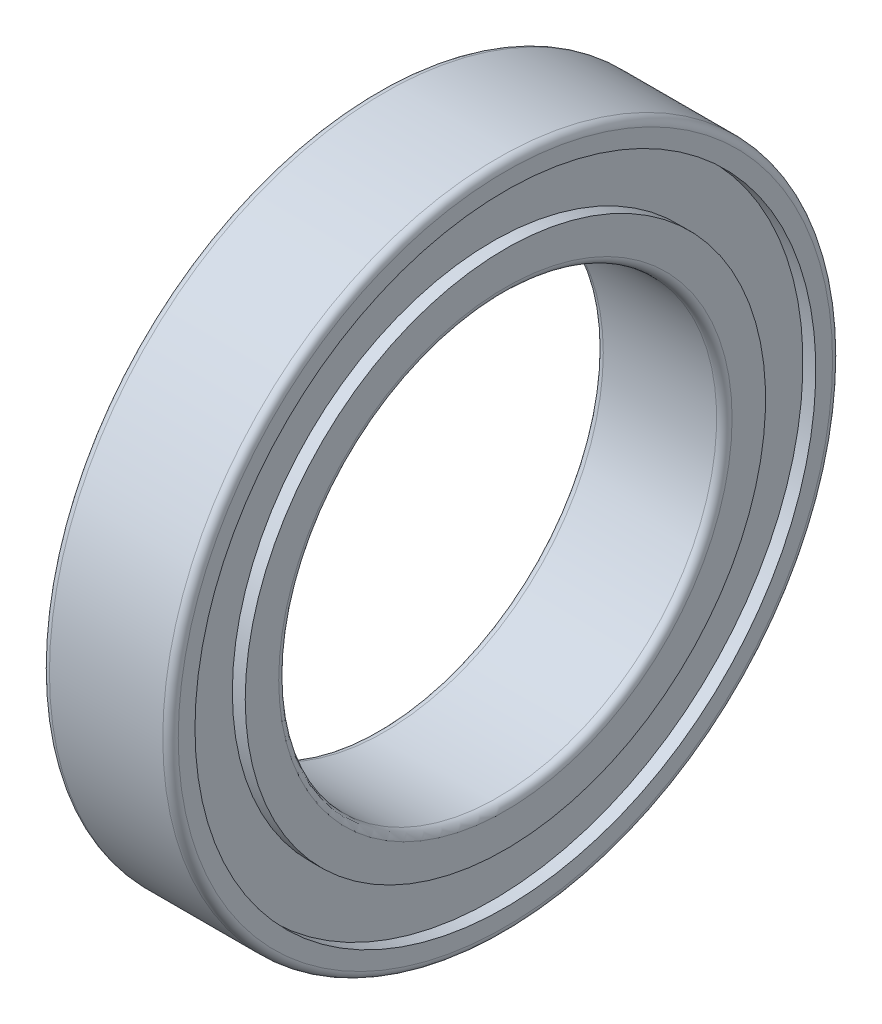
ISO-10303-21;
HEADER;
FILE_DESCRIPTION(('STEP AP214'),'2;1');
FILE_NAME('part.step','',(''),(''),'','','');
FILE_SCHEMA(('AUTOMOTIVE_DESIGN { 1 0 10303 214 1 1 1 1 }'));
ENDSEC;
DATA;
#1=APPLICATION_CONTEXT('core data for automotive mechanical design processes');
#2=APPLICATION_PROTOCOL_DEFINITION('international standard','automotive_design',2000,#1);
#3=PRODUCT_CONTEXT('',#1,'mechanical');
#4=PRODUCT('Part','Part','',(#3));
#5=PRODUCT_RELATED_PRODUCT_CATEGORY('part','',(#4));
#6=PRODUCT_DEFINITION_FORMATION('','',#4);
#7=PRODUCT_DEFINITION_CONTEXT('part definition',#1,'design');
#8=PRODUCT_DEFINITION('design','',#6,#7);
#9=PRODUCT_DEFINITION_SHAPE('','',#8);
#10=(LENGTH_UNIT() NAMED_UNIT(*) SI_UNIT(.MILLI.,.METRE.));
#11=(NAMED_UNIT(*) PLANE_ANGLE_UNIT() SI_UNIT($,.RADIAN.));
#12=(NAMED_UNIT(*) SI_UNIT($,.STERADIAN.) SOLID_ANGLE_UNIT());
#13=UNCERTAINTY_MEASURE_WITH_UNIT(LENGTH_MEASURE(1.E-05),#10,'distance_accuracy_value','');
#14=(GEOMETRIC_REPRESENTATION_CONTEXT(3) GLOBAL_UNCERTAINTY_ASSIGNED_CONTEXT((#13)) GLOBAL_UNIT_ASSIGNED_CONTEXT((#10,
#11,#12)) REPRESENTATION_CONTEXT('',''));
#15=CARTESIAN_POINT('',(0.,0.,0.));
#16=DIRECTION('',(0.,0.,1.));
#17=DIRECTION('',(1.,0.,0.));
#18=AXIS2_PLACEMENT_3D('',#15,#16,#17);
#19=CARTESIAN_POINT('',(0.,0.,0.));
#20=DIRECTION('',(-1.,0.,0.));
#21=DIRECTION('',(0.,0.,1.));
#22=AXIS2_PLACEMENT_3D('',#19,#20,#21);
#23=CYLINDRICAL_SURFACE('',#22,8.5);
#24=CARTESIAN_POINT('',(4.7,0.,0.));
#25=DIRECTION('',(-1.,0.,0.));
#26=DIRECTION('',(0.,0.,1.));
#27=AXIS2_PLACEMENT_3D('',#24,#25,#26);
#28=CIRCLE('',#27,8.5);
#29=CARTESIAN_POINT('',(4.7,0.,8.5));
#30=VERTEX_POINT('',#29);
#31=EDGE_CURVE('E260',#30,#30,#28,.T.);
#32=ORIENTED_EDGE('',*,*,#31,.F.);
#33=EDGE_LOOP('',(#32));
#34=FACE_BOUND('',#33,.T.);
#35=CARTESIAN_POINT('',(0.3,0.,0.));
#36=DIRECTION('',(1.,0.,0.));
#37=DIRECTION('',(0.,0.,-1.));
#38=AXIS2_PLACEMENT_3D('',#35,#36,#37);
#39=CIRCLE('',#38,8.5);
#40=CARTESIAN_POINT('',(0.3,0.,-8.5));
#41=VERTEX_POINT('',#40);
#42=EDGE_CURVE('E64',#41,#41,#39,.T.);
#43=ORIENTED_EDGE('',*,*,#42,.F.);
#44=EDGE_LOOP('',(#43));
#45=FACE_BOUND('',#44,.T.);
#46=ADVANCED_FACE('F17',(#34,#45),#23,.F.);
#47=CARTESIAN_POINT('',(4.7,0.,0.));
#48=DIRECTION('',(-1.,0.,0.));
#49=DIRECTION('',(0.,0.,1.));
#50=AXIS2_PLACEMENT_3D('',#47,#48,#49);
#51=TOROIDAL_SURFACE('',#50,8.8,0.3);
#52=CARTESIAN_POINT('',(5.,0.,0.));
#53=DIRECTION('',(1.,0.,0.));
#54=DIRECTION('',(0.,0.,1.));
#55=AXIS2_PLACEMENT_3D('',#52,#53,#54);
#56=CIRCLE('',#55,8.8);
#57=CARTESIAN_POINT('',(5.,0.,8.8));
#58=VERTEX_POINT('',#57);
#59=CARTESIAN_POINT('',(5.,0.,-8.8));
#60=VERTEX_POINT('',#59);
#61=EDGE_CURVE('E59',#58,#60,#56,.T.);
#62=ORIENTED_EDGE('',*,*,#61,.T.);
#63=CARTESIAN_POINT('',(5.,0.,0.));
#64=DIRECTION('',(1.,0.,0.));
#65=DIRECTION('',(0.,0.,-1.));
#66=AXIS2_PLACEMENT_3D('',#63,#64,#65);
#67=CIRCLE('',#66,8.8);
#68=EDGE_CURVE('E56',#60,#58,#67,.T.);
#69=ORIENTED_EDGE('',*,*,#68,.T.);
#70=EDGE_LOOP('',(#62,#69));
#71=FACE_BOUND('',#70,.T.);
#72=ORIENTED_EDGE('',*,*,#31,.T.);
#73=EDGE_LOOP('',(#72));
#74=FACE_BOUND('',#73,.T.);
#75=ADVANCED_FACE('F60',(#71,#74),#51,.T.);
#76=CARTESIAN_POINT('',(0.3,0.,0.));
#77=DIRECTION('',(1.,0.,0.));
#78=DIRECTION('',(0.,0.,-1.));
#79=AXIS2_PLACEMENT_3D('',#76,#77,#78);
#80=TOROIDAL_SURFACE('',#79,8.8,0.3);
#81=CARTESIAN_POINT('',(0.,0.,0.));
#82=DIRECTION('',(-1.,0.,0.));
#83=DIRECTION('',(0.,0.,-1.));
#84=AXIS2_PLACEMENT_3D('',#81,#82,#83);
#85=CIRCLE('',#84,8.8);
#86=CARTESIAN_POINT('',(0.,0.,-8.8));
#87=VERTEX_POINT('',#86);
#88=CARTESIAN_POINT('',(0.,0.,8.8));
#89=VERTEX_POINT('',#88);
#90=EDGE_CURVE('E69',#87,#89,#85,.T.);
#91=ORIENTED_EDGE('',*,*,#90,.T.);
#92=CARTESIAN_POINT('',(0.,0.,0.));
#93=DIRECTION('',(-1.,0.,0.));
#94=DIRECTION('',(0.,0.,1.));
#95=AXIS2_PLACEMENT_3D('',#92,#93,#94);
#96=CIRCLE('',#95,8.8);
#97=EDGE_CURVE('E222',#89,#87,#96,.T.);
#98=ORIENTED_EDGE('',*,*,#97,.T.);
#99=EDGE_LOOP('',(#91,#98));
#100=FACE_BOUND('',#99,.T.);
#101=ORIENTED_EDGE('',*,*,#42,.T.);
#102=EDGE_LOOP('',(#101));
#103=FACE_BOUND('',#102,.T.);
#104=ADVANCED_FACE('F90',(#100,#103),#80,.T.);
#105=CARTESIAN_POINT('',(5.,8.5,0.));
#106=DIRECTION('',(-1.,0.,0.));
#107=DIRECTION('',(0.,0.,1.));
#108=AXIS2_PLACEMENT_3D('',#105,#106,#107);
#109=PLANE('',#108);
#110=ORIENTED_EDGE('',*,*,#61,.F.);
#111=ORIENTED_EDGE('',*,*,#68,.F.);
#112=EDGE_LOOP('',(#110,#111));
#113=FACE_BOUND('',#112,.T.);
#114=CARTESIAN_POINT('',(5.,0.,0.));
#115=DIRECTION('',(-1.,0.,0.));
#116=DIRECTION('',(0.,0.,1.));
#117=AXIS2_PLACEMENT_3D('',#114,#115,#116);
#118=CIRCLE('',#117,10.1);
#119=CARTESIAN_POINT('',(5.,0.,10.1));
#120=VERTEX_POINT('',#119);
#121=EDGE_CURVE('E231',#120,#120,#118,.T.);
#122=ORIENTED_EDGE('',*,*,#121,.F.);
#123=EDGE_LOOP('',(#122));
#124=FACE_BOUND('',#123,.T.);
#125=ADVANCED_FACE('F67',(#113,#124),#109,.F.);
#126=CARTESIAN_POINT('',(0.,8.5,0.));
#127=DIRECTION('',(1.,0.,0.));
#128=DIRECTION('',(0.,0.,-1.));
#129=AXIS2_PLACEMENT_3D('',#126,#127,#128);
#130=PLANE('',#129);
#131=ORIENTED_EDGE('',*,*,#90,.F.);
#132=ORIENTED_EDGE('',*,*,#97,.F.);
#133=EDGE_LOOP('',(#131,#132));
#134=FACE_BOUND('',#133,.T.);
#135=CARTESIAN_POINT('',(0.,0.,0.));
#136=DIRECTION('',(-1.,0.,0.));
#137=DIRECTION('',(0.,0.,1.));
#138=AXIS2_PLACEMENT_3D('',#135,#136,#137);
#139=CIRCLE('',#138,10.1);
#140=CARTESIAN_POINT('',(0.,0.,10.1));
#141=VERTEX_POINT('',#140);
#142=EDGE_CURVE('E233',#141,#141,#139,.F.);
#143=ORIENTED_EDGE('',*,*,#142,.F.);
#144=EDGE_LOOP('',(#143));
#145=FACE_BOUND('',#144,.T.);
#146=ADVANCED_FACE('F89',(#134,#145),#130,.F.);
#147=CARTESIAN_POINT('',(0.,0.,0.));
#148=DIRECTION('',(-1.,0.,0.));
#149=DIRECTION('',(0.,0.,1.));
#150=AXIS2_PLACEMENT_3D('',#147,#148,#149);
#151=CYLINDRICAL_SURFACE('',#150,10.1);
#152=CARTESIAN_POINT('',(4.5,0.,0.));
#153=DIRECTION('',(-1.,0.,0.));
#154=DIRECTION('',(0.,0.,1.));
#155=AXIS2_PLACEMENT_3D('',#152,#153,#154);
#156=CIRCLE('',#155,10.1);
#157=CARTESIAN_POINT('',(4.5,0.,10.1));
#158=VERTEX_POINT('',#157);
#159=EDGE_CURVE('E238',#158,#158,#156,.F.);
#160=ORIENTED_EDGE('',*,*,#159,.T.);
#161=EDGE_LOOP('',(#160));
#162=FACE_BOUND('',#161,.T.);
#163=ORIENTED_EDGE('',*,*,#121,.T.);
#164=EDGE_LOOP('',(#163));
#165=FACE_BOUND('',#164,.T.);
#166=ADVANCED_FACE('F273',(#162,#165),#151,.T.);
#167=CARTESIAN_POINT('',(0.,0.,0.));
#168=DIRECTION('',(-1.,0.,0.));
#169=DIRECTION('',(0.,0.,1.));
#170=AXIS2_PLACEMENT_3D('',#167,#168,#169);
#171=CYLINDRICAL_SURFACE('',#170,10.1);
#172=ORIENTED_EDGE('',*,*,#142,.T.);
#173=EDGE_LOOP('',(#172));
#174=FACE_BOUND('',#173,.T.);
#175=CARTESIAN_POINT('',(0.5,0.,0.));
#176=DIRECTION('',(-1.,0.,0.));
#177=DIRECTION('',(0.,0.,1.));
#178=AXIS2_PLACEMENT_3D('',#175,#176,#177);
#179=CIRCLE('',#178,10.1);
#180=CARTESIAN_POINT('',(0.5,0.,10.1));
#181=VERTEX_POINT('',#180);
#182=EDGE_CURVE('E268',#181,#181,#179,.T.);
#183=ORIENTED_EDGE('',*,*,#182,.T.);
#184=EDGE_LOOP('',(#183));
#185=FACE_BOUND('',#184,.T.);
#186=ADVANCED_FACE('F279',(#174,#185),#171,.T.);
#187=CARTESIAN_POINT('',(4.5,12.05,0.));
#188=DIRECTION('',(-1.,0.,0.));
#189=DIRECTION('',(0.,0.,1.));
#190=AXIS2_PLACEMENT_3D('',#187,#188,#189);
#191=PLANE('',#190);
#192=ORIENTED_EDGE('',*,*,#159,.F.);
#193=EDGE_LOOP('',(#192));
#194=FACE_BOUND('',#193,.T.);
#195=CARTESIAN_POINT('',(4.5,0.,0.));
#196=DIRECTION('',(-1.,0.,0.));
#197=DIRECTION('',(0.,0.,1.));
#198=AXIS2_PLACEMENT_3D('',#195,#196,#197);
#199=CIRCLE('',#198,12.05);
#200=CARTESIAN_POINT('',(4.5,0.,12.05));
#201=VERTEX_POINT('',#200);
#202=EDGE_CURVE('E265',#201,#201,#199,.F.);
#203=ORIENTED_EDGE('',*,*,#202,.T.);
#204=EDGE_LOOP('',(#203));
#205=FACE_BOUND('',#204,.T.);
#206=ADVANCED_FACE('F275',(#194,#205),#191,.F.);
#207=CARTESIAN_POINT('',(0.5,10.1,0.));
#208=DIRECTION('',(1.,0.,0.));
#209=DIRECTION('',(0.,0.,-1.));
#210=AXIS2_PLACEMENT_3D('',#207,#208,#209);
#211=PLANE('',#210);
#212=ORIENTED_EDGE('',*,*,#182,.F.);
#213=EDGE_LOOP('',(#212));
#214=FACE_BOUND('',#213,.T.);
#215=CARTESIAN_POINT('',(0.5,0.,0.));
#216=DIRECTION('',(-1.,0.,0.));
#217=DIRECTION('',(0.,0.,1.));
#218=AXIS2_PLACEMENT_3D('',#215,#216,#217);
#219=CIRCLE('',#218,12.05);
#220=CARTESIAN_POINT('',(0.5,0.,12.05));
#221=VERTEX_POINT('',#220);
#222=EDGE_CURVE('E257',#221,#221,#219,.T.);
#223=ORIENTED_EDGE('',*,*,#222,.T.);
#224=EDGE_LOOP('',(#223));
#225=FACE_BOUND('',#224,.T.);
#226=ADVANCED_FACE('F278',(#214,#225),#211,.F.);
#227=CARTESIAN_POINT('',(0.,0.,0.));
#228=DIRECTION('',(-1.,0.,0.));
#229=DIRECTION('',(0.,0.,1.));
#230=AXIS2_PLACEMENT_3D('',#227,#228,#229);
#231=CYLINDRICAL_SURFACE('',#230,12.05);
#232=CARTESIAN_POINT('',(5.,0.,0.));
#233=DIRECTION('',(-1.,0.,0.));
#234=DIRECTION('',(0.,0.,1.));
#235=AXIS2_PLACEMENT_3D('',#232,#233,#234);
#236=CIRCLE('',#235,12.05);
#237=CARTESIAN_POINT('',(5.,0.,12.05));
#238=VERTEX_POINT('',#237);
#239=EDGE_CURVE('E252',#238,#238,#236,.F.);
#240=ORIENTED_EDGE('',*,*,#239,.T.);
#241=EDGE_LOOP('',(#240));
#242=FACE_BOUND('',#241,.T.);
#243=ORIENTED_EDGE('',*,*,#202,.F.);
#244=EDGE_LOOP('',(#243));
#245=FACE_BOUND('',#244,.T.);
#246=ADVANCED_FACE('F283',(#242,#245),#231,.F.);
#247=CARTESIAN_POINT('',(0.,0.,0.));
#248=DIRECTION('',(-1.,0.,0.));
#249=DIRECTION('',(0.,0.,1.));
#250=AXIS2_PLACEMENT_3D('',#247,#248,#249);
#251=CYLINDRICAL_SURFACE('',#250,12.05);
#252=ORIENTED_EDGE('',*,*,#222,.F.);
#253=EDGE_LOOP('',(#252));
#254=FACE_BOUND('',#253,.T.);
#255=CARTESIAN_POINT('',(0.,0.,0.));
#256=DIRECTION('',(-1.,0.,0.));
#257=DIRECTION('',(0.,0.,1.));
#258=AXIS2_PLACEMENT_3D('',#255,#256,#257);
#259=CIRCLE('',#258,12.05);
#260=CARTESIAN_POINT('',(0.,0.,12.05));
#261=VERTEX_POINT('',#260);
#262=EDGE_CURVE('E250',#261,#261,#259,.T.);
#263=ORIENTED_EDGE('',*,*,#262,.T.);
#264=EDGE_LOOP('',(#263));
#265=FACE_BOUND('',#264,.T.);
#266=ADVANCED_FACE('F190',(#254,#265),#251,.F.);
#267=CARTESIAN_POINT('',(5.,13.,0.));
#268=DIRECTION('',(-1.,0.,0.));
#269=DIRECTION('',(0.,0.,1.));
#270=AXIS2_PLACEMENT_3D('',#267,#268,#269);
#271=PLANE('',#270);
#272=ORIENTED_EDGE('',*,*,#239,.F.);
#273=EDGE_LOOP('',(#272));
#274=FACE_BOUND('',#273,.T.);
#275=CARTESIAN_POINT('',(5.,0.,0.));
#276=DIRECTION('',(-1.,0.,0.));
#277=DIRECTION('',(0.,0.,1.));
#278=AXIS2_PLACEMENT_3D('',#275,#276,#277);
#279=CIRCLE('',#278,12.7);
#280=CARTESIAN_POINT('',(5.,0.,12.7));
#281=VERTEX_POINT('',#280);
#282=CARTESIAN_POINT('',(5.,0.,-12.7));
#283=VERTEX_POINT('',#282);
#284=EDGE_CURVE('E176',#281,#283,#279,.T.);
#285=ORIENTED_EDGE('',*,*,#284,.F.);
#286=CARTESIAN_POINT('',(5.,0.,0.));
#287=DIRECTION('',(-1.,0.,0.));
#288=DIRECTION('',(0.,0.,-1.));
#289=AXIS2_PLACEMENT_3D('',#286,#287,#288);
#290=CIRCLE('',#289,12.7);
#291=EDGE_CURVE('E249',#283,#281,#290,.T.);
#292=ORIENTED_EDGE('',*,*,#291,.F.);
#293=EDGE_LOOP('',(#285,#292));
#294=FACE_BOUND('',#293,.T.);
#295=ADVANCED_FACE('F181',(#274,#294),#271,.F.);
#296=CARTESIAN_POINT('',(0.,12.05,0.));
#297=DIRECTION('',(1.,0.,0.));
#298=DIRECTION('',(0.,0.,-1.));
#299=AXIS2_PLACEMENT_3D('',#296,#297,#298);
#300=PLANE('',#299);
#301=ORIENTED_EDGE('',*,*,#262,.F.);
#302=EDGE_LOOP('',(#301));
#303=FACE_BOUND('',#302,.T.);
#304=CARTESIAN_POINT('',(0.,0.,0.));
#305=DIRECTION('',(1.,0.,0.));
#306=DIRECTION('',(0.,0.,-1.));
#307=AXIS2_PLACEMENT_3D('',#304,#305,#306);
#308=CIRCLE('',#307,12.7);
#309=CARTESIAN_POINT('',(0.,0.,-12.7));
#310=VERTEX_POINT('',#309);
#311=CARTESIAN_POINT('',(0.,0.,12.7));
#312=VERTEX_POINT('',#311);
#313=EDGE_CURVE('E146',#310,#312,#308,.T.);
#314=ORIENTED_EDGE('',*,*,#313,.F.);
#315=CARTESIAN_POINT('',(0.,0.,0.));
#316=DIRECTION('',(1.,0.,0.));
#317=DIRECTION('',(0.,0.,1.));
#318=AXIS2_PLACEMENT_3D('',#315,#316,#317);
#319=CIRCLE('',#318,12.7);
#320=EDGE_CURVE('E35',#312,#310,#319,.T.);
#321=ORIENTED_EDGE('',*,*,#320,.F.);
#322=EDGE_LOOP('',(#314,#321));
#323=FACE_BOUND('',#322,.T.);
#324=ADVANCED_FACE('F132',(#303,#323),#300,.F.);
#325=CARTESIAN_POINT('',(4.7,0.,0.));
#326=DIRECTION('',(-1.,0.,0.));
#327=DIRECTION('',(0.,0.,1.));
#328=AXIS2_PLACEMENT_3D('',#325,#326,#327);
#329=TOROIDAL_SURFACE('',#328,12.7,0.3);
#330=CARTESIAN_POINT('',(4.7,0.,0.));
#331=DIRECTION('',(-1.,0.,0.));
#332=DIRECTION('',(0.,0.,1.));
#333=AXIS2_PLACEMENT_3D('',#330,#331,#332);
#334=CIRCLE('',#333,13.);
#335=CARTESIAN_POINT('',(4.7,0.,13.));
#336=VERTEX_POINT('',#335);
#337=EDGE_CURVE('E27',#336,#336,#334,.T.);
#338=ORIENTED_EDGE('',*,*,#337,.F.);
#339=EDGE_LOOP('',(#338));
#340=FACE_BOUND('',#339,.T.);
#341=ORIENTED_EDGE('',*,*,#284,.T.);
#342=ORIENTED_EDGE('',*,*,#291,.T.);
#343=EDGE_LOOP('',(#341,#342));
#344=FACE_BOUND('',#343,.T.);
#345=ADVANCED_FACE('F120',(#340,#344),#329,.T.);
#346=CARTESIAN_POINT('',(0.3,0.,0.));
#347=DIRECTION('',(1.,0.,0.));
#348=DIRECTION('',(0.,0.,-1.));
#349=AXIS2_PLACEMENT_3D('',#346,#347,#348);
#350=TOROIDAL_SURFACE('',#349,12.7,0.3);
#351=CARTESIAN_POINT('',(0.3,0.,0.));
#352=DIRECTION('',(-1.,0.,0.));
#353=DIRECTION('',(0.,0.,1.));
#354=AXIS2_PLACEMENT_3D('',#351,#352,#353);
#355=CIRCLE('',#354,13.);
#356=CARTESIAN_POINT('',(0.3,0.,13.));
#357=VERTEX_POINT('',#356);
#358=EDGE_CURVE('E11',#357,#357,#355,.F.);
#359=ORIENTED_EDGE('',*,*,#358,.F.);
#360=EDGE_LOOP('',(#359));
#361=FACE_BOUND('',#360,.T.);
#362=ORIENTED_EDGE('',*,*,#313,.T.);
#363=ORIENTED_EDGE('',*,*,#320,.T.);
#364=EDGE_LOOP('',(#362,#363));
#365=FACE_BOUND('',#364,.T.);
#366=ADVANCED_FACE('F131',(#361,#365),#350,.T.);
#367=CARTESIAN_POINT('',(0.,0.,0.));
#368=DIRECTION('',(-1.,0.,0.));
#369=DIRECTION('',(0.,0.,1.));
#370=AXIS2_PLACEMENT_3D('',#367,#368,#369);
#371=CYLINDRICAL_SURFACE('',#370,13.);
#372=ORIENTED_EDGE('',*,*,#358,.T.);
#373=EDGE_LOOP('',(#372));
#374=FACE_BOUND('',#373,.T.);
#375=ORIENTED_EDGE('',*,*,#337,.T.);
#376=EDGE_LOOP('',(#375));
#377=FACE_BOUND('',#376,.T.);
#378=ADVANCED_FACE('F294',(#374,#377),#371,.T.);
#379=CLOSED_SHELL('',(#46,#75,#104,#125,#146,#166,#186,#206,#226,#246,#266,#295,#324,#345,#366,#378));
#380=MANIFOLD_SOLID_BREP('B1',#379);
#381=ADVANCED_BREP_SHAPE_REPRESENTATION('',(#18,#380),#14);
#382=SHAPE_DEFINITION_REPRESENTATION(#9,#381);
ENDSEC;
END-ISO-10303-21;
